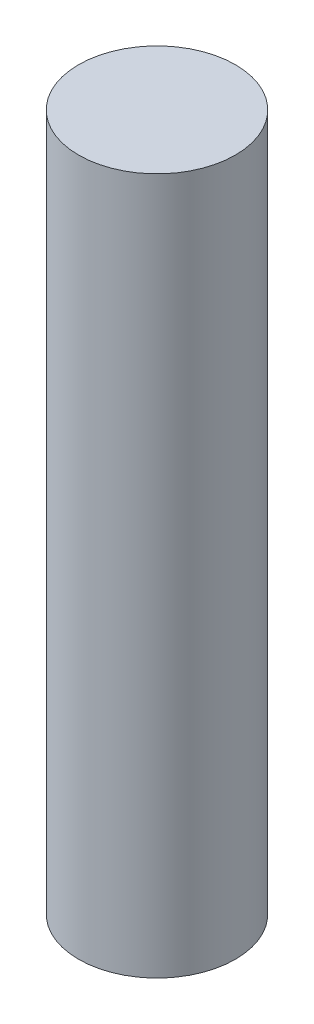
ISO-10303-21;
HEADER;
FILE_DESCRIPTION(('STEP AP214'),'2;1');
FILE_NAME('part.step','',(''),(''),'','','');
FILE_SCHEMA(('AUTOMOTIVE_DESIGN { 1 0 10303 214 1 1 1 1 }'));
ENDSEC;
DATA;
#1=APPLICATION_CONTEXT('core data for automotive mechanical design processes');
#2=APPLICATION_PROTOCOL_DEFINITION('international standard','automotive_design',2000,#1);
#3=PRODUCT_CONTEXT('',#1,'mechanical');
#4=PRODUCT('Part','Part','',(#3));
#5=PRODUCT_RELATED_PRODUCT_CATEGORY('part','',(#4));
#6=PRODUCT_DEFINITION_FORMATION('','',#4);
#7=PRODUCT_DEFINITION_CONTEXT('part definition',#1,'design');
#8=PRODUCT_DEFINITION('design','',#6,#7);
#9=PRODUCT_DEFINITION_SHAPE('','',#8);
#10=(LENGTH_UNIT() NAMED_UNIT(*) SI_UNIT(.MILLI.,.METRE.));
#11=(NAMED_UNIT(*) PLANE_ANGLE_UNIT() SI_UNIT($,.RADIAN.));
#12=(NAMED_UNIT(*) SI_UNIT($,.STERADIAN.) SOLID_ANGLE_UNIT());
#13=UNCERTAINTY_MEASURE_WITH_UNIT(LENGTH_MEASURE(1.E-05),#10,'distance_accuracy_value','');
#14=(GEOMETRIC_REPRESENTATION_CONTEXT(3) GLOBAL_UNCERTAINTY_ASSIGNED_CONTEXT((#13)) GLOBAL_UNIT_ASSIGNED_CONTEXT((#10,
#11,#12)) REPRESENTATION_CONTEXT('',''));
#15=CARTESIAN_POINT('',(0.,0.,0.));
#16=DIRECTION('',(0.,0.,1.));
#17=DIRECTION('',(1.,0.,0.));
#18=AXIS2_PLACEMENT_3D('',#15,#16,#17);
#19=CARTESIAN_POINT('',(0.,20.,0.));
#20=DIRECTION('',(0.,-1.,0.));
#21=DIRECTION('',(0.,0.,-1.));
#22=AXIS2_PLACEMENT_3D('',#19,#20,#21);
#23=CYLINDRICAL_SURFACE('',#22,2.25);
#24=CARTESIAN_POINT('',(0.,20.,0.));
#25=DIRECTION('',(0.,1.,0.));
#26=DIRECTION('',(0.,0.,1.));
#27=AXIS2_PLACEMENT_3D('',#24,#25,#26);
#28=CIRCLE('',#27,2.25);
#29=CARTESIAN_POINT('',(0.,20.,2.25));
#30=VERTEX_POINT('',#29);
#31=EDGE_CURVE('E10',#30,#30,#28,.T.);
#32=ORIENTED_EDGE('',*,*,#31,.F.);
#33=EDGE_LOOP('',(#32));
#34=FACE_BOUND('',#33,.T.);
#35=CARTESIAN_POINT('',(0.,0.,0.));
#36=DIRECTION('',(0.,1.,0.));
#37=DIRECTION('',(0.,0.,1.));
#38=AXIS2_PLACEMENT_3D('',#35,#36,#37);
#39=CIRCLE('',#38,2.25);
#40=CARTESIAN_POINT('',(0.,0.,2.25));
#41=VERTEX_POINT('',#40);
#42=EDGE_CURVE('E37',#41,#41,#39,.T.);
#43=ORIENTED_EDGE('',*,*,#42,.T.);
#44=EDGE_LOOP('',(#43));
#45=FACE_BOUND('',#44,.T.);
#46=ADVANCED_FACE('F34',(#34,#45),#23,.T.);
#47=CARTESIAN_POINT('',(0.,20.,0.));
#48=DIRECTION('',(0.,1.,0.));
#49=DIRECTION('',(0.,0.,1.));
#50=AXIS2_PLACEMENT_3D('',#47,#48,#49);
#51=PLANE('',#50);
#52=ORIENTED_EDGE('',*,*,#31,.T.);
#53=EDGE_LOOP('',(#52));
#54=FACE_BOUND('',#53,.T.);
#55=ADVANCED_FACE('F53',(#54),#51,.T.);
#56=CARTESIAN_POINT('',(0.,0.,0.));
#57=DIRECTION('',(0.,1.,0.));
#58=DIRECTION('',(0.,0.,1.));
#59=AXIS2_PLACEMENT_3D('',#56,#57,#58);
#60=PLANE('',#59);
#61=ORIENTED_EDGE('',*,*,#42,.F.);
#62=EDGE_LOOP('',(#61));
#63=FACE_BOUND('',#62,.T.);
#64=ADVANCED_FACE('F51',(#63),#60,.F.);
#65=CLOSED_SHELL('',(#46,#55,#64));
#66=MANIFOLD_SOLID_BREP('B2',#65);
#67=ADVANCED_BREP_SHAPE_REPRESENTATION('',(#18,#66),#14);
#68=SHAPE_DEFINITION_REPRESENTATION(#9,#67);
ENDSEC;
END-ISO-10303-21;
